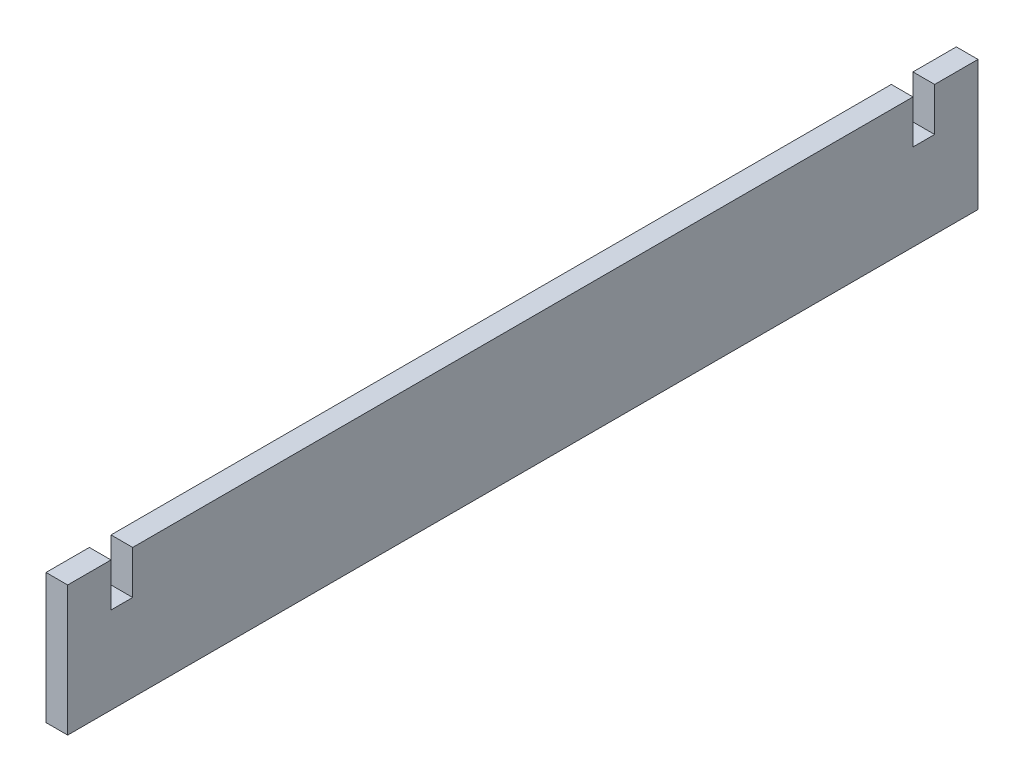
ISO-10303-21;
HEADER;
FILE_DESCRIPTION(('STEP AP214'),'2;1');
FILE_NAME('part.step','',(''),(''),'','','');
FILE_SCHEMA(('AUTOMOTIVE_DESIGN { 1 0 10303 214 1 1 1 1 }'));
ENDSEC;
DATA;
#1=APPLICATION_CONTEXT('core data for automotive mechanical design processes');
#2=APPLICATION_PROTOCOL_DEFINITION('international standard','automotive_design',2000,#1);
#3=PRODUCT_CONTEXT('',#1,'mechanical');
#4=PRODUCT('Part','Part','',(#3));
#5=PRODUCT_RELATED_PRODUCT_CATEGORY('part','',(#4));
#6=PRODUCT_DEFINITION_FORMATION('','',#4);
#7=PRODUCT_DEFINITION_CONTEXT('part definition',#1,'design');
#8=PRODUCT_DEFINITION('design','',#6,#7);
#9=PRODUCT_DEFINITION_SHAPE('','',#8);
#10=(LENGTH_UNIT() NAMED_UNIT(*) SI_UNIT(.MILLI.,.METRE.));
#11=(NAMED_UNIT(*) PLANE_ANGLE_UNIT() SI_UNIT($,.RADIAN.));
#12=(NAMED_UNIT(*) SI_UNIT($,.STERADIAN.) SOLID_ANGLE_UNIT());
#13=UNCERTAINTY_MEASURE_WITH_UNIT(LENGTH_MEASURE(1.E-05),#10,'distance_accuracy_value','');
#14=(GEOMETRIC_REPRESENTATION_CONTEXT(3) GLOBAL_UNCERTAINTY_ASSIGNED_CONTEXT((#13)) GLOBAL_UNIT_ASSIGNED_CONTEXT((#10,
#11,#12)) REPRESENTATION_CONTEXT('',''));
#15=CARTESIAN_POINT('',(0.,0.,0.));
#16=DIRECTION('',(0.,0.,1.));
#17=DIRECTION('',(1.,0.,0.));
#18=AXIS2_PLACEMENT_3D('',#15,#16,#17);
#19=CARTESIAN_POINT('',(-6.34999999999999,38.1,533.4));
#20=DIRECTION('',(0.,-1.,0.));
#21=DIRECTION('',(0.,0.,-1.));
#22=AXIS2_PLACEMENT_3D('',#19,#20,#21);
#23=PLANE('',#22);
#24=DIRECTION('',(0.,0.,-1.));
#25=VECTOR('',#24,1.);
#26=CARTESIAN_POINT('',(6.34999999999999,38.1,533.4));
#27=LINE('',#26,#25);
#28=CARTESIAN_POINT('',(6.34999999999999,38.1,533.4));
#29=VERTEX_POINT('',#28);
#30=CARTESIAN_POINT('',(6.34999999999999,38.1,508.));
#31=VERTEX_POINT('',#30);
#32=EDGE_CURVE('E11',#29,#31,#27,.T.);
#33=ORIENTED_EDGE('',*,*,#32,.T.);
#34=DIRECTION('',(1.,0.,0.));
#35=VECTOR('',#34,1.);
#36=CARTESIAN_POINT('',(-6.34999999999999,38.1,508.));
#37=LINE('',#36,#35);
#38=CARTESIAN_POINT('',(-6.34999999999999,38.1,508.));
#39=VERTEX_POINT('',#38);
#40=EDGE_CURVE('E155',#39,#31,#37,.T.);
#41=ORIENTED_EDGE('',*,*,#40,.F.);
#42=DIRECTION('',(0.,0.,-1.));
#43=VECTOR('',#42,1.);
#44=CARTESIAN_POINT('',(-6.34999999999999,38.1,533.4));
#45=LINE('',#44,#43);
#46=CARTESIAN_POINT('',(-6.34999999999999,38.1,533.4));
#47=VERTEX_POINT('',#46);
#48=EDGE_CURVE('E145',#47,#39,#45,.T.);
#49=ORIENTED_EDGE('',*,*,#48,.F.);
#50=DIRECTION('',(-1.,0.,0.));
#51=VECTOR('',#50,1.);
#52=CARTESIAN_POINT('',(-6.34999999999999,38.1,533.4));
#53=LINE('',#52,#51);
#54=EDGE_CURVE('E188',#29,#47,#53,.T.);
#55=ORIENTED_EDGE('',*,*,#54,.F.);
#56=EDGE_LOOP('',(#33,#41,#49,#55));
#57=FACE_BOUND('',#56,.T.);
#58=ADVANCED_FACE('F34',(#57),#23,.F.);
#59=CARTESIAN_POINT('',(-6.34999999999999,38.1000000000001,25.4));
#60=VERTEX_POINT('',#59);
#61=CARTESIAN_POINT('',(-6.34999999999999,38.1,0.));
#62=VERTEX_POINT('',#61);
#63=EDGE_CURVE('E208',#60,#62,#45,.T.);
#64=ORIENTED_EDGE('',*,*,#63,.F.);
#65=DIRECTION('',(1.,0.,0.));
#66=VECTOR('',#65,1.);
#67=CARTESIAN_POINT('',(-6.34999999999999,38.1000000000001,25.4));
#68=LINE('',#67,#66);
#69=CARTESIAN_POINT('',(6.34999999999999,38.1000000000001,25.4));
#70=VERTEX_POINT('',#69);
#71=EDGE_CURVE('E153',#60,#70,#68,.T.);
#72=ORIENTED_EDGE('',*,*,#71,.T.);
#73=CARTESIAN_POINT('',(6.34999999999999,38.1,0.));
#74=VERTEX_POINT('',#73);
#75=EDGE_CURVE('E43',#70,#74,#27,.T.);
#76=ORIENTED_EDGE('',*,*,#75,.T.);
#77=DIRECTION('',(-1.,0.,0.));
#78=VECTOR('',#77,1.);
#79=CARTESIAN_POINT('',(-6.34999999999999,38.1,0.));
#80=LINE('',#79,#78);
#81=EDGE_CURVE('E198',#74,#62,#80,.T.);
#82=ORIENTED_EDGE('',*,*,#81,.T.);
#83=EDGE_LOOP('',(#64,#72,#76,#82));
#84=FACE_BOUND('',#83,.T.);
#85=ADVANCED_FACE('F217',(#84),#23,.F.);
#86=CARTESIAN_POINT('',(6.34999999999999,-38.1,533.4));
#87=DIRECTION('',(-1.,0.,0.));
#88=DIRECTION('',(0.,0.,1.));
#89=AXIS2_PLACEMENT_3D('',#86,#87,#88);
#90=PLANE('',#89);
#91=DIRECTION('',(0.,0.,-1.));
#92=VECTOR('',#91,1.);
#93=CARTESIAN_POINT('',(6.34999999999999,12.7,508.));
#94=LINE('',#93,#92);
#95=CARTESIAN_POINT('',(6.34999999999999,12.7,508.));
#96=VERTEX_POINT('',#95);
#97=CARTESIAN_POINT('',(6.34999999999999,12.7,495.3));
#98=VERTEX_POINT('',#97);
#99=EDGE_CURVE('E148',#96,#98,#94,.T.);
#100=ORIENTED_EDGE('',*,*,#99,.F.);
#101=DIRECTION('',(0.,-1.,0.));
#102=VECTOR('',#101,1.);
#103=CARTESIAN_POINT('',(6.34999999999999,38.1,508.));
#104=LINE('',#103,#102);
#105=EDGE_CURVE('E130',#31,#96,#104,.T.);
#106=ORIENTED_EDGE('',*,*,#105,.F.);
#107=ORIENTED_EDGE('',*,*,#32,.F.);
#108=DIRECTION('',(0.,1.,0.));
#109=VECTOR('',#108,1.);
#110=CARTESIAN_POINT('',(6.34999999999999,-38.1,533.4));
#111=LINE('',#110,#109);
#112=CARTESIAN_POINT('',(6.34999999999999,-38.1,533.4));
#113=VERTEX_POINT('',#112);
#114=EDGE_CURVE('E185',#113,#29,#111,.T.);
#115=ORIENTED_EDGE('',*,*,#114,.F.);
#116=DIRECTION('',(0.,0.,-1.));
#117=VECTOR('',#116,1.);
#118=CARTESIAN_POINT('',(6.34999999999999,-38.1,533.4));
#119=LINE('',#118,#117);
#120=CARTESIAN_POINT('',(6.34999999999999,-38.1,0.));
#121=VERTEX_POINT('',#120);
#122=EDGE_CURVE('E195',#113,#121,#119,.T.);
#123=ORIENTED_EDGE('',*,*,#122,.T.);
#124=DIRECTION('',(0.,1.,0.));
#125=VECTOR('',#124,1.);
#126=CARTESIAN_POINT('',(6.34999999999999,-38.1,0.));
#127=LINE('',#126,#125);
#128=EDGE_CURVE('E157',#121,#74,#127,.T.);
#129=ORIENTED_EDGE('',*,*,#128,.T.);
#130=ORIENTED_EDGE('',*,*,#75,.F.);
#131=DIRECTION('',(0.,1.,0.));
#132=VECTOR('',#131,1.);
#133=CARTESIAN_POINT('',(6.34999999999999,38.1000000000001,25.4));
#134=LINE('',#133,#132);
#135=CARTESIAN_POINT('',(6.34999999999999,12.7000000000001,25.4));
#136=VERTEX_POINT('',#135);
#137=EDGE_CURVE('E165',#136,#70,#134,.T.);
#138=ORIENTED_EDGE('',*,*,#137,.F.);
#139=DIRECTION('',(0.,0.,-1.));
#140=VECTOR('',#139,1.);
#141=CARTESIAN_POINT('',(6.34999999999999,12.7000000000001,25.4));
#142=LINE('',#141,#140);
#143=CARTESIAN_POINT('',(6.34999999999999,12.7000000000001,38.1));
#144=VERTEX_POINT('',#143);
#145=EDGE_CURVE('E174',#144,#136,#142,.T.);
#146=ORIENTED_EDGE('',*,*,#145,.F.);
#147=DIRECTION('',(0.,-1.,0.));
#148=VECTOR('',#147,1.);
#149=CARTESIAN_POINT('',(6.34999999999999,38.1000000000001,38.1));
#150=LINE('',#149,#148);
#151=CARTESIAN_POINT('',(6.34999999999999,38.1000000000001,38.1));
#152=VERTEX_POINT('',#151);
#153=EDGE_CURVE('E171',#152,#144,#150,.T.);
#154=ORIENTED_EDGE('',*,*,#153,.F.);
#155=CARTESIAN_POINT('',(6.34999999999999,38.1,495.3));
#156=VERTEX_POINT('',#155);
#157=EDGE_CURVE('E42',#156,#152,#27,.T.);
#158=ORIENTED_EDGE('',*,*,#157,.F.);
#159=DIRECTION('',(0.,1.,0.));
#160=VECTOR('',#159,1.);
#161=CARTESIAN_POINT('',(6.34999999999999,38.1,495.3));
#162=LINE('',#161,#160);
#163=EDGE_CURVE('E146',#98,#156,#162,.T.);
#164=ORIENTED_EDGE('',*,*,#163,.F.);
#165=EDGE_LOOP('',(#100,#106,#107,#115,#123,#129,#130,#138,#146,#154,#158,#164));
#166=FACE_BOUND('',#165,.T.);
#167=ADVANCED_FACE('F36',(#166),#90,.F.);
#168=CARTESIAN_POINT('',(-6.34999999999999,38.1,495.3));
#169=VERTEX_POINT('',#168);
#170=CARTESIAN_POINT('',(-6.34999999999999,38.1000000000001,38.1));
#171=VERTEX_POINT('',#170);
#172=EDGE_CURVE('E209',#169,#171,#45,.T.);
#173=ORIENTED_EDGE('',*,*,#172,.F.);
#174=DIRECTION('',(1.,0.,0.));
#175=VECTOR('',#174,1.);
#176=CARTESIAN_POINT('',(-6.34999999999999,38.1,495.3));
#177=LINE('',#176,#175);
#178=EDGE_CURVE('E158',#169,#156,#177,.T.);
#179=ORIENTED_EDGE('',*,*,#178,.T.);
#180=ORIENTED_EDGE('',*,*,#157,.T.);
#181=DIRECTION('',(1.,0.,0.));
#182=VECTOR('',#181,1.);
#183=CARTESIAN_POINT('',(-6.34999999999999,38.1000000000001,38.1));
#184=LINE('',#183,#182);
#185=EDGE_CURVE('E170',#171,#152,#184,.T.);
#186=ORIENTED_EDGE('',*,*,#185,.F.);
#187=EDGE_LOOP('',(#173,#179,#180,#186));
#188=FACE_BOUND('',#187,.T.);
#189=ADVANCED_FACE('F240',(#188),#23,.F.);
#190=CARTESIAN_POINT('',(-6.34999999999999,-38.1,533.4));
#191=DIRECTION('',(1.,0.,0.));
#192=DIRECTION('',(0.,0.,-1.));
#193=AXIS2_PLACEMENT_3D('',#190,#191,#192);
#194=PLANE('',#193);
#195=ORIENTED_EDGE('',*,*,#48,.T.);
#196=DIRECTION('',(0.,-1.,0.));
#197=VECTOR('',#196,1.);
#198=CARTESIAN_POINT('',(-6.34999999999999,38.1,508.));
#199=LINE('',#198,#197);
#200=CARTESIAN_POINT('',(-6.34999999999999,12.7,508.));
#201=VERTEX_POINT('',#200);
#202=EDGE_CURVE('E127',#39,#201,#199,.T.);
#203=ORIENTED_EDGE('',*,*,#202,.T.);
#204=DIRECTION('',(0.,0.,-1.));
#205=VECTOR('',#204,1.);
#206=CARTESIAN_POINT('',(-6.34999999999999,12.7,508.));
#207=LINE('',#206,#205);
#208=CARTESIAN_POINT('',(-6.34999999999999,12.7,495.3));
#209=VERTEX_POINT('',#208);
#210=EDGE_CURVE('E137',#201,#209,#207,.T.);
#211=ORIENTED_EDGE('',*,*,#210,.T.);
#212=DIRECTION('',(0.,1.,0.));
#213=VECTOR('',#212,1.);
#214=CARTESIAN_POINT('',(-6.34999999999999,38.1,495.3));
#215=LINE('',#214,#213);
#216=EDGE_CURVE('E50',#209,#169,#215,.T.);
#217=ORIENTED_EDGE('',*,*,#216,.T.);
#218=ORIENTED_EDGE('',*,*,#172,.T.);
#219=DIRECTION('',(0.,-1.,0.));
#220=VECTOR('',#219,1.);
#221=CARTESIAN_POINT('',(-6.34999999999999,38.1000000000001,38.1));
#222=LINE('',#221,#220);
#223=CARTESIAN_POINT('',(-6.34999999999999,12.7000000000001,38.1));
#224=VERTEX_POINT('',#223);
#225=EDGE_CURVE('E162',#171,#224,#222,.T.);
#226=ORIENTED_EDGE('',*,*,#225,.T.);
#227=DIRECTION('',(0.,0.,-1.));
#228=VECTOR('',#227,1.);
#229=CARTESIAN_POINT('',(-6.34999999999999,12.7000000000001,25.4));
#230=LINE('',#229,#228);
#231=CARTESIAN_POINT('',(-6.34999999999999,12.7000000000001,25.4));
#232=VERTEX_POINT('',#231);
#233=EDGE_CURVE('E58',#224,#232,#230,.T.);
#234=ORIENTED_EDGE('',*,*,#233,.T.);
#235=DIRECTION('',(0.,1.,0.));
#236=VECTOR('',#235,1.);
#237=CARTESIAN_POINT('',(-6.34999999999999,38.1000000000001,25.4));
#238=LINE('',#237,#236);
#239=EDGE_CURVE('E167',#232,#60,#238,.T.);
#240=ORIENTED_EDGE('',*,*,#239,.T.);
#241=ORIENTED_EDGE('',*,*,#63,.T.);
#242=DIRECTION('',(0.,-1.,0.));
#243=VECTOR('',#242,1.);
#244=CARTESIAN_POINT('',(-6.34999999999999,-38.1,0.));
#245=LINE('',#244,#243);
#246=CARTESIAN_POINT('',(-6.34999999999999,-38.1,0.));
#247=VERTEX_POINT('',#246);
#248=EDGE_CURVE('E201',#62,#247,#245,.T.);
#249=ORIENTED_EDGE('',*,*,#248,.T.);
#250=DIRECTION('',(0.,0.,-1.));
#251=VECTOR('',#250,1.);
#252=CARTESIAN_POINT('',(-6.34999999999999,-38.1,533.4));
#253=LINE('',#252,#251);
#254=CARTESIAN_POINT('',(-6.34999999999999,-38.1,533.4));
#255=VERTEX_POINT('',#254);
#256=EDGE_CURVE('E206',#255,#247,#253,.T.);
#257=ORIENTED_EDGE('',*,*,#256,.F.);
#258=DIRECTION('',(0.,-1.,0.));
#259=VECTOR('',#258,1.);
#260=CARTESIAN_POINT('',(-6.34999999999999,-38.1,533.4));
#261=LINE('',#260,#259);
#262=EDGE_CURVE('E191',#47,#255,#261,.T.);
#263=ORIENTED_EDGE('',*,*,#262,.F.);
#264=EDGE_LOOP('',(#195,#203,#211,#217,#218,#226,#234,#240,#241,#249,#257,#263));
#265=FACE_BOUND('',#264,.T.);
#266=ADVANCED_FACE('F142',(#265),#194,.F.);
#267=CARTESIAN_POINT('',(-6.34999999999999,-38.1,533.4));
#268=DIRECTION('',(0.,1.,0.));
#269=DIRECTION('',(0.,0.,1.));
#270=AXIS2_PLACEMENT_3D('',#267,#268,#269);
#271=PLANE('',#270);
#272=DIRECTION('',(1.,0.,0.));
#273=VECTOR('',#272,1.);
#274=CARTESIAN_POINT('',(-6.34999999999999,-38.1,0.));
#275=LINE('',#274,#273);
#276=EDGE_CURVE('E189',#247,#121,#275,.T.);
#277=ORIENTED_EDGE('',*,*,#276,.T.);
#278=ORIENTED_EDGE('',*,*,#122,.F.);
#279=DIRECTION('',(1.,0.,0.));
#280=VECTOR('',#279,1.);
#281=CARTESIAN_POINT('',(-6.34999999999999,-38.1,533.4));
#282=LINE('',#281,#280);
#283=EDGE_CURVE('E193',#255,#113,#282,.T.);
#284=ORIENTED_EDGE('',*,*,#283,.F.);
#285=ORIENTED_EDGE('',*,*,#256,.T.);
#286=EDGE_LOOP('',(#277,#278,#284,#285));
#287=FACE_BOUND('',#286,.T.);
#288=ADVANCED_FACE('F225',(#287),#271,.F.);
#289=CARTESIAN_POINT('',(0.,0.,533.4));
#290=DIRECTION('',(0.,0.,-1.));
#291=DIRECTION('',(-1.,0.,0.));
#292=AXIS2_PLACEMENT_3D('',#289,#290,#291);
#293=PLANE('',#292);
#294=ORIENTED_EDGE('',*,*,#114,.T.);
#295=ORIENTED_EDGE('',*,*,#54,.T.);
#296=ORIENTED_EDGE('',*,*,#262,.T.);
#297=ORIENTED_EDGE('',*,*,#283,.T.);
#298=EDGE_LOOP('',(#294,#295,#296,#297));
#299=FACE_BOUND('',#298,.T.);
#300=ADVANCED_FACE('F231',(#299),#293,.F.);
#301=CARTESIAN_POINT('',(0.,0.,0.));
#302=DIRECTION('',(0.,0.,-1.));
#303=DIRECTION('',(-1.,0.,0.));
#304=AXIS2_PLACEMENT_3D('',#301,#302,#303);
#305=PLANE('',#304);
#306=ORIENTED_EDGE('',*,*,#128,.F.);
#307=ORIENTED_EDGE('',*,*,#276,.F.);
#308=ORIENTED_EDGE('',*,*,#248,.F.);
#309=ORIENTED_EDGE('',*,*,#81,.F.);
#310=EDGE_LOOP('',(#306,#307,#308,#309));
#311=FACE_BOUND('',#310,.T.);
#312=ADVANCED_FACE('F222',(#311),#305,.T.);
#313=CARTESIAN_POINT('',(-6.34999999999999,38.1000000000001,25.4));
#314=DIRECTION('',(0.,0.,-1.));
#315=DIRECTION('',(-1.,0.,0.));
#316=AXIS2_PLACEMENT_3D('',#313,#314,#315);
#317=PLANE('',#316);
#318=ORIENTED_EDGE('',*,*,#137,.T.);
#319=ORIENTED_EDGE('',*,*,#71,.F.);
#320=ORIENTED_EDGE('',*,*,#239,.F.);
#321=DIRECTION('',(1.,0.,0.));
#322=VECTOR('',#321,1.);
#323=CARTESIAN_POINT('',(-6.34999999999999,12.7000000000001,25.4));
#324=LINE('',#323,#322);
#325=EDGE_CURVE('E180',#232,#136,#324,.T.);
#326=ORIENTED_EDGE('',*,*,#325,.T.);
#327=EDGE_LOOP('',(#318,#319,#320,#326));
#328=FACE_BOUND('',#327,.T.);
#329=ADVANCED_FACE('F248',(#328),#317,.F.);
#330=CARTESIAN_POINT('',(-6.34999999999999,12.7000000000001,25.4));
#331=DIRECTION('',(0.,-1.,0.));
#332=DIRECTION('',(0.,0.,-1.));
#333=AXIS2_PLACEMENT_3D('',#330,#331,#332);
#334=PLANE('',#333);
#335=ORIENTED_EDGE('',*,*,#145,.T.);
#336=ORIENTED_EDGE('',*,*,#325,.F.);
#337=ORIENTED_EDGE('',*,*,#233,.F.);
#338=DIRECTION('',(1.,0.,0.));
#339=VECTOR('',#338,1.);
#340=CARTESIAN_POINT('',(-6.34999999999999,12.7000000000001,38.1));
#341=LINE('',#340,#339);
#342=EDGE_CURVE('E182',#224,#144,#341,.T.);
#343=ORIENTED_EDGE('',*,*,#342,.T.);
#344=EDGE_LOOP('',(#335,#336,#337,#343));
#345=FACE_BOUND('',#344,.T.);
#346=ADVANCED_FACE('F245',(#345),#334,.F.);
#347=CARTESIAN_POINT('',(-6.34999999999999,38.1000000000001,38.1));
#348=DIRECTION('',(0.,0.,1.));
#349=DIRECTION('',(1.,0.,0.));
#350=AXIS2_PLACEMENT_3D('',#347,#348,#349);
#351=PLANE('',#350);
#352=ORIENTED_EDGE('',*,*,#153,.T.);
#353=ORIENTED_EDGE('',*,*,#342,.F.);
#354=ORIENTED_EDGE('',*,*,#225,.F.);
#355=ORIENTED_EDGE('',*,*,#185,.T.);
#356=EDGE_LOOP('',(#352,#353,#354,#355));
#357=FACE_BOUND('',#356,.T.);
#358=ADVANCED_FACE('F243',(#357),#351,.F.);
#359=CARTESIAN_POINT('',(-6.34999999999999,38.1,508.));
#360=DIRECTION('',(0.,0.,1.));
#361=DIRECTION('',(1.,0.,0.));
#362=AXIS2_PLACEMENT_3D('',#359,#360,#361);
#363=PLANE('',#362);
#364=ORIENTED_EDGE('',*,*,#105,.T.);
#365=DIRECTION('',(1.,0.,0.));
#366=VECTOR('',#365,1.);
#367=CARTESIAN_POINT('',(-6.34999999999999,12.7,508.));
#368=LINE('',#367,#366);
#369=EDGE_CURVE('E123',#201,#96,#368,.T.);
#370=ORIENTED_EDGE('',*,*,#369,.F.);
#371=ORIENTED_EDGE('',*,*,#202,.F.);
#372=ORIENTED_EDGE('',*,*,#40,.T.);
#373=EDGE_LOOP('',(#364,#370,#371,#372));
#374=FACE_BOUND('',#373,.T.);
#375=ADVANCED_FACE('F125',(#374),#363,.F.);
#376=CARTESIAN_POINT('',(-6.34999999999999,38.1,495.3));
#377=DIRECTION('',(0.,0.,-1.));
#378=DIRECTION('',(-1.,0.,0.));
#379=AXIS2_PLACEMENT_3D('',#376,#377,#378);
#380=PLANE('',#379);
#381=ORIENTED_EDGE('',*,*,#163,.T.);
#382=ORIENTED_EDGE('',*,*,#178,.F.);
#383=ORIENTED_EDGE('',*,*,#216,.F.);
#384=DIRECTION('',(1.,0.,0.));
#385=VECTOR('',#384,1.);
#386=CARTESIAN_POINT('',(-6.34999999999999,12.7,495.3));
#387=LINE('',#386,#385);
#388=EDGE_CURVE('E134',#209,#98,#387,.T.);
#389=ORIENTED_EDGE('',*,*,#388,.T.);
#390=EDGE_LOOP('',(#381,#382,#383,#389));
#391=FACE_BOUND('',#390,.T.);
#392=ADVANCED_FACE('F237',(#391),#380,.F.);
#393=CARTESIAN_POINT('',(-6.34999999999999,12.7,508.));
#394=DIRECTION('',(0.,-1.,0.));
#395=DIRECTION('',(0.,0.,-1.));
#396=AXIS2_PLACEMENT_3D('',#393,#394,#395);
#397=PLANE('',#396);
#398=ORIENTED_EDGE('',*,*,#99,.T.);
#399=ORIENTED_EDGE('',*,*,#388,.F.);
#400=ORIENTED_EDGE('',*,*,#210,.F.);
#401=ORIENTED_EDGE('',*,*,#369,.T.);
#402=EDGE_LOOP('',(#398,#399,#400,#401));
#403=FACE_BOUND('',#402,.T.);
#404=ADVANCED_FACE('F138',(#403),#397,.F.);
#405=CLOSED_SHELL('',(#58,#85,#167,#189,#266,#288,#300,#312,#329,#346,#358,#375,#392,#404));
#406=MANIFOLD_SOLID_BREP('B2',#405);
#407=ADVANCED_BREP_SHAPE_REPRESENTATION('',(#18,#406),#14);
#408=SHAPE_DEFINITION_REPRESENTATION(#9,#407);
ENDSEC;
END-ISO-10303-21;
